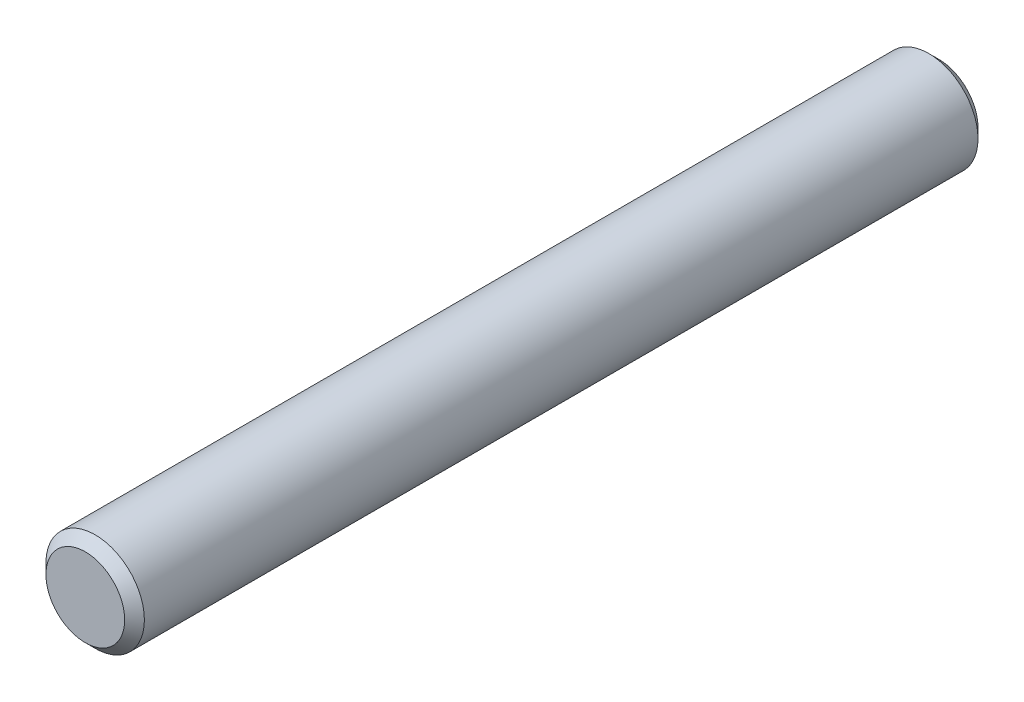
ISO-10303-21;
HEADER;
FILE_DESCRIPTION(('STEP AP214'),'2;1');
FILE_NAME('part.step','',(''),(''),'','','');
FILE_SCHEMA(('AUTOMOTIVE_DESIGN { 1 0 10303 214 1 1 1 1 }'));
ENDSEC;
DATA;
#1=APPLICATION_CONTEXT('core data for automotive mechanical design processes');
#2=APPLICATION_PROTOCOL_DEFINITION('international standard','automotive_design',2000,#1);
#3=PRODUCT_CONTEXT('',#1,'mechanical');
#4=PRODUCT('Part','Part','',(#3));
#5=PRODUCT_RELATED_PRODUCT_CATEGORY('part','',(#4));
#6=PRODUCT_DEFINITION_FORMATION('','',#4);
#7=PRODUCT_DEFINITION_CONTEXT('part definition',#1,'design');
#8=PRODUCT_DEFINITION('design','',#6,#7);
#9=PRODUCT_DEFINITION_SHAPE('','',#8);
#10=(LENGTH_UNIT() NAMED_UNIT(*) SI_UNIT(.MILLI.,.METRE.));
#11=(NAMED_UNIT(*) PLANE_ANGLE_UNIT() SI_UNIT($,.RADIAN.));
#12=(NAMED_UNIT(*) SI_UNIT($,.STERADIAN.) SOLID_ANGLE_UNIT());
#13=UNCERTAINTY_MEASURE_WITH_UNIT(LENGTH_MEASURE(1.E-05),#10,'distance_accuracy_value','');
#14=(GEOMETRIC_REPRESENTATION_CONTEXT(3) GLOBAL_UNCERTAINTY_ASSIGNED_CONTEXT((#13)) GLOBAL_UNIT_ASSIGNED_CONTEXT((#10,
#11,#12)) REPRESENTATION_CONTEXT('',''));
#15=CARTESIAN_POINT('',(0.,0.,0.));
#16=DIRECTION('',(0.,0.,1.));
#17=DIRECTION('',(1.,0.,0.));
#18=AXIS2_PLACEMENT_3D('',#15,#16,#17);
#19=CARTESIAN_POINT('',(0.,0.,13.));
#20=DIRECTION('',(0.,0.,-1.));
#21=DIRECTION('',(-1.,0.,0.));
#22=AXIS2_PLACEMENT_3D('',#19,#20,#21);
#23=CYLINDRICAL_SURFACE('',#22,1.5);
#24=CARTESIAN_POINT('',(0.,0.,-12.7));
#25=DIRECTION('',(0.,0.,1.));
#26=DIRECTION('',(1.,0.,0.));
#27=AXIS2_PLACEMENT_3D('',#24,#25,#26);
#28=CIRCLE('',#27,1.5);
#29=CARTESIAN_POINT('',(1.5,0.,-12.7));
#30=VERTEX_POINT('',#29);
#31=EDGE_CURVE('E27',#30,#30,#28,.T.);
#32=ORIENTED_EDGE('',*,*,#31,.T.);
#33=EDGE_LOOP('',(#32));
#34=FACE_BOUND('',#33,.T.);
#35=CARTESIAN_POINT('',(0.,0.,12.7));
#36=DIRECTION('',(0.,0.,1.));
#37=DIRECTION('',(1.,0.,0.));
#38=AXIS2_PLACEMENT_3D('',#35,#36,#37);
#39=CIRCLE('',#38,1.5);
#40=CARTESIAN_POINT('',(1.5,0.,12.7));
#41=VERTEX_POINT('',#40);
#42=EDGE_CURVE('E31',#41,#41,#39,.F.);
#43=ORIENTED_EDGE('',*,*,#42,.T.);
#44=EDGE_LOOP('',(#43));
#45=FACE_BOUND('',#44,.T.);
#46=ADVANCED_FACE('F15',(#34,#45),#23,.T.);
#47=CARTESIAN_POINT('',(0.,0.,13.));
#48=DIRECTION('',(0.,0.,1.));
#49=DIRECTION('',(1.,0.,0.));
#50=AXIS2_PLACEMENT_3D('',#47,#48,#49);
#51=PLANE('',#50);
#52=CARTESIAN_POINT('',(0.,0.,13.));
#53=DIRECTION('',(0.,0.,1.));
#54=DIRECTION('',(1.,0.,0.));
#55=AXIS2_PLACEMENT_3D('',#52,#53,#54);
#56=CIRCLE('',#55,1.20000000000002);
#57=CARTESIAN_POINT('',(1.20000000000002,0.,13.));
#58=VERTEX_POINT('',#57);
#59=EDGE_CURVE('E10',#58,#58,#56,.T.);
#60=ORIENTED_EDGE('',*,*,#59,.T.);
#61=EDGE_LOOP('',(#60));
#62=FACE_BOUND('',#61,.T.);
#63=ADVANCED_FACE('F49',(#62),#51,.T.);
#64=CARTESIAN_POINT('',(0.,0.,-13.));
#65=DIRECTION('',(0.,0.,1.));
#66=DIRECTION('',(1.,0.,0.));
#67=AXIS2_PLACEMENT_3D('',#64,#65,#66);
#68=PLANE('',#67);
#69=CARTESIAN_POINT('',(0.,0.,-13.));
#70=DIRECTION('',(0.,0.,1.));
#71=DIRECTION('',(1.,0.,0.));
#72=AXIS2_PLACEMENT_3D('',#69,#70,#71);
#73=CIRCLE('',#72,1.19999999999998);
#74=CARTESIAN_POINT('',(1.19999999999998,0.,-13.));
#75=VERTEX_POINT('',#74);
#76=EDGE_CURVE('E23',#75,#75,#73,.F.);
#77=ORIENTED_EDGE('',*,*,#76,.T.);
#78=EDGE_LOOP('',(#77));
#79=FACE_BOUND('',#78,.T.);
#80=ADVANCED_FACE('F46',(#79),#68,.F.);
#81=CARTESIAN_POINT('',(0.,0.,-12.7));
#82=DIRECTION('',(0.,0.,1.));
#83=DIRECTION('',(1.,0.,0.));
#84=AXIS2_PLACEMENT_3D('',#81,#82,#83);
#85=CONICAL_SURFACE('',#84,1.5,0.785398163397459);
#86=ORIENTED_EDGE('',*,*,#76,.F.);
#87=EDGE_LOOP('',(#86));
#88=FACE_BOUND('',#87,.T.);
#89=ORIENTED_EDGE('',*,*,#31,.F.);
#90=EDGE_LOOP('',(#89));
#91=FACE_BOUND('',#90,.T.);
#92=ADVANCED_FACE('F40',(#88,#91),#85,.T.);
#93=CARTESIAN_POINT('',(0.,0.,13.));
#94=DIRECTION('',(0.,0.,-1.));
#95=DIRECTION('',(-1.,0.,0.));
#96=AXIS2_PLACEMENT_3D('',#93,#94,#95);
#97=CONICAL_SURFACE('',#96,1.20000000000002,0.785398163397445);
#98=ORIENTED_EDGE('',*,*,#42,.F.);
#99=EDGE_LOOP('',(#98));
#100=FACE_BOUND('',#99,.T.);
#101=ORIENTED_EDGE('',*,*,#59,.F.);
#102=EDGE_LOOP('',(#101));
#103=FACE_BOUND('',#102,.T.);
#104=ADVANCED_FACE('F18',(#100,#103),#97,.T.);
#105=CLOSED_SHELL('',(#46,#63,#80,#92,#104));
#106=MANIFOLD_SOLID_BREP('B1',#105);
#107=ADVANCED_BREP_SHAPE_REPRESENTATION('',(#18,#106),#14);
#108=SHAPE_DEFINITION_REPRESENTATION(#9,#107);
ENDSEC;
END-ISO-10303-21;
